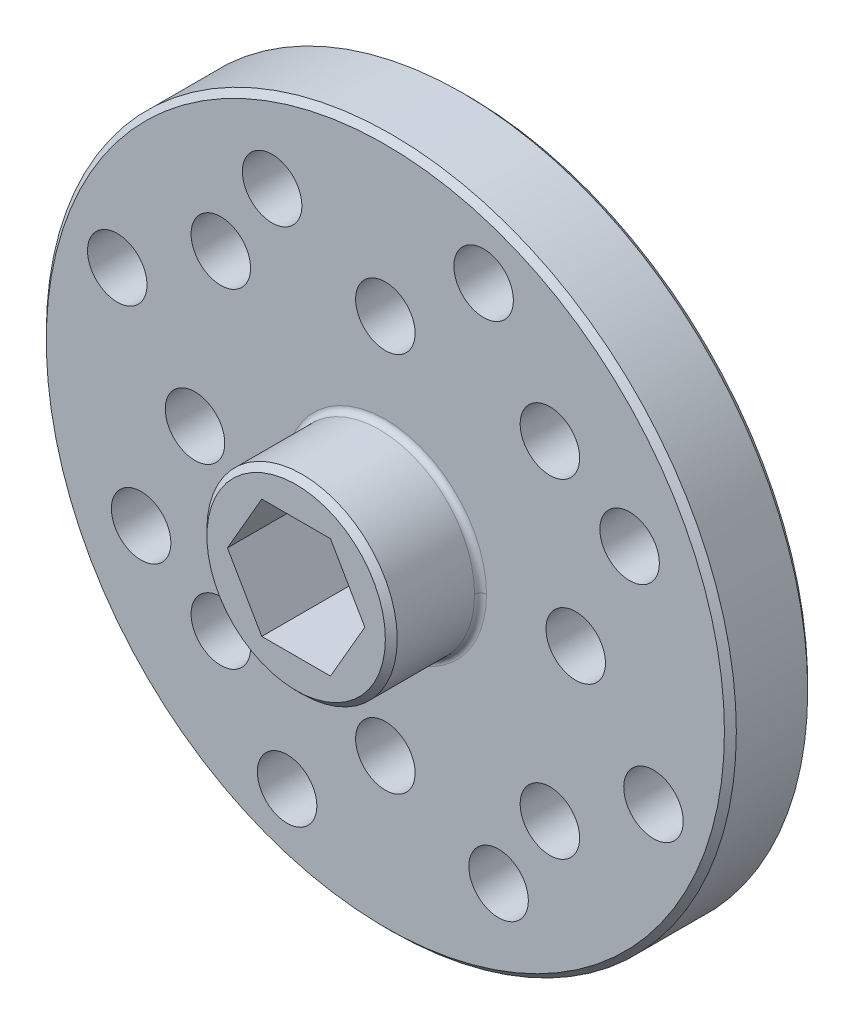
ISO-10303-21;
HEADER;
FILE_DESCRIPTION(('STEP AP214'),'2;1');
FILE_NAME('part.step','',(''),(''),'','','');
FILE_SCHEMA(('AUTOMOTIVE_DESIGN { 1 0 10303 214 1 1 1 1 }'));
ENDSEC;
DATA;
#1=APPLICATION_CONTEXT('core data for automotive mechanical design processes');
#2=APPLICATION_PROTOCOL_DEFINITION('international standard','automotive_design',2000,#1);
#3=PRODUCT_CONTEXT('',#1,'mechanical');
#4=PRODUCT('Part','Part','',(#3));
#5=PRODUCT_RELATED_PRODUCT_CATEGORY('part','',(#4));
#6=PRODUCT_DEFINITION_FORMATION('','',#4);
#7=PRODUCT_DEFINITION_CONTEXT('part definition',#1,'design');
#8=PRODUCT_DEFINITION('design','',#6,#7);
#9=PRODUCT_DEFINITION_SHAPE('','',#8);
#10=(LENGTH_UNIT() NAMED_UNIT(*) SI_UNIT(.MILLI.,.METRE.));
#11=(NAMED_UNIT(*) PLANE_ANGLE_UNIT() SI_UNIT($,.RADIAN.));
#12=(NAMED_UNIT(*) SI_UNIT($,.STERADIAN.) SOLID_ANGLE_UNIT());
#13=UNCERTAINTY_MEASURE_WITH_UNIT(LENGTH_MEASURE(1.E-05),#10,'distance_accuracy_value','');
#14=(GEOMETRIC_REPRESENTATION_CONTEXT(3) GLOBAL_UNCERTAINTY_ASSIGNED_CONTEXT((#13)) GLOBAL_UNIT_ASSIGNED_CONTEXT((#10,
#11,#12)) REPRESENTATION_CONTEXT('',''));
#15=CARTESIAN_POINT('',(0.,0.,0.));
#16=DIRECTION('',(0.,0.,1.));
#17=DIRECTION('',(1.,0.,0.));
#18=AXIS2_PLACEMENT_3D('',#15,#16,#17);
#19=CARTESIAN_POINT('',(0.,0.,7.5));
#20=DIRECTION('',(0.,0.,-1.));
#21=DIRECTION('',(0.,1.,0.));
#22=AXIS2_PLACEMENT_3D('',#19,#20,#21);
#23=TOROIDAL_SURFACE('',#22,4.25,0.25);
#24=CARTESIAN_POINT('',(0.,0.,7.5));
#25=DIRECTION('',(0.,0.,1.));
#26=DIRECTION('',(1.,0.,0.));
#27=AXIS2_PLACEMENT_3D('',#24,#25,#26);
#28=CIRCLE('',#27,4.);
#29=CARTESIAN_POINT('',(-4.,0.,7.5));
#30=VERTEX_POINT('',#29);
#31=CARTESIAN_POINT('',(4.,0.,7.5));
#32=VERTEX_POINT('',#31);
#33=EDGE_CURVE('E273',#30,#32,#28,.T.);
#34=ORIENTED_EDGE('',*,*,#33,.F.);
#35=CARTESIAN_POINT('',(-4.25,0.,7.5));
#36=DIRECTION('',(0.,1.,0.));
#37=DIRECTION('',(-1.,0.,0.));
#38=AXIS2_PLACEMENT_3D('',#35,#36,#37);
#39=CIRCLE('',#38,0.25);
#40=CARTESIAN_POINT('',(-4.25,0.,7.25));
#41=VERTEX_POINT('',#40);
#42=EDGE_CURVE('E268',#30,#41,#39,.T.);
#43=ORIENTED_EDGE('',*,*,#42,.T.);
#44=CARTESIAN_POINT('',(0.,0.,7.25));
#45=DIRECTION('',(0.,0.,1.));
#46=DIRECTION('',(-1.,0.,0.));
#47=AXIS2_PLACEMENT_3D('',#44,#45,#46);
#48=CIRCLE('',#47,4.25);
#49=CARTESIAN_POINT('',(4.25,0.,7.25));
#50=VERTEX_POINT('',#49);
#51=EDGE_CURVE('E251',#41,#50,#48,.T.);
#52=ORIENTED_EDGE('',*,*,#51,.T.);
#53=CARTESIAN_POINT('',(4.25,0.,7.5));
#54=DIRECTION('',(0.,-1.,0.));
#55=DIRECTION('',(1.,0.,0.));
#56=AXIS2_PLACEMENT_3D('',#53,#54,#55);
#57=CIRCLE('',#56,0.25);
#58=EDGE_CURVE('E269',#32,#50,#57,.T.);
#59=ORIENTED_EDGE('',*,*,#58,.F.);
#60=EDGE_LOOP('',(#34,#43,#52,#59));
#61=FACE_BOUND('',#60,.T.);
#62=ADVANCED_FACE('F16',(#61),#23,.F.);
#63=CARTESIAN_POINT('',(0.,0.,3.5));
#64=DIRECTION('',(0.,0.,1.));
#65=DIRECTION('',(0.,-1.,0.));
#66=AXIS2_PLACEMENT_3D('',#63,#64,#65);
#67=TOROIDAL_SURFACE('',#66,6.6,0.249999999999997);
#68=CARTESIAN_POINT('',(0.,0.,3.5));
#69=DIRECTION('',(0.,0.,-1.));
#70=DIRECTION('',(-1.,0.,0.));
#71=AXIS2_PLACEMENT_3D('',#68,#69,#70);
#72=CIRCLE('',#71,6.35);
#73=CARTESIAN_POINT('',(6.35,0.,3.5));
#74=VERTEX_POINT('',#73);
#75=CARTESIAN_POINT('',(-6.35,0.,3.5));
#76=VERTEX_POINT('',#75);
#77=EDGE_CURVE('E375',#74,#76,#72,.T.);
#78=ORIENTED_EDGE('',*,*,#77,.F.);
#79=CARTESIAN_POINT('',(6.6,0.,3.5));
#80=DIRECTION('',(0.,1.,0.));
#81=DIRECTION('',(1.,0.,0.));
#82=AXIS2_PLACEMENT_3D('',#79,#80,#81);
#83=CIRCLE('',#82,0.25);
#84=CARTESIAN_POINT('',(6.6,0.,3.75));
#85=VERTEX_POINT('',#84);
#86=EDGE_CURVE('E322',#74,#85,#83,.T.);
#87=ORIENTED_EDGE('',*,*,#86,.T.);
#88=CARTESIAN_POINT('',(0.,0.,3.75));
#89=DIRECTION('',(0.,0.,-1.));
#90=DIRECTION('',(1.,0.,0.));
#91=AXIS2_PLACEMENT_3D('',#88,#89,#90);
#92=CIRCLE('',#91,6.6);
#93=CARTESIAN_POINT('',(-6.6,0.,3.75));
#94=VERTEX_POINT('',#93);
#95=EDGE_CURVE('E388',#85,#94,#92,.T.);
#96=ORIENTED_EDGE('',*,*,#95,.T.);
#97=CARTESIAN_POINT('',(-6.6,0.,3.5));
#98=DIRECTION('',(0.,-1.,0.));
#99=DIRECTION('',(-1.,0.,0.));
#100=AXIS2_PLACEMENT_3D('',#97,#98,#99);
#101=CIRCLE('',#100,0.25);
#102=EDGE_CURVE('E409',#76,#94,#101,.T.);
#103=ORIENTED_EDGE('',*,*,#102,.F.);
#104=EDGE_LOOP('',(#78,#87,#96,#103));
#105=FACE_BOUND('',#104,.T.);
#106=ADVANCED_FACE('F540',(#105),#67,.F.);
#107=CARTESIAN_POINT('',(0.,0.,7.25));
#108=DIRECTION('',(0.,0.,-1.));
#109=DIRECTION('',(1.,0.,0.));
#110=AXIS2_PLACEMENT_3D('',#107,#108,#109);
#111=CONICAL_SURFACE('',#110,14.25,0.785398163397435);
#112=CARTESIAN_POINT('',(0.,0.,7.25));
#113=DIRECTION('',(0.,0.,1.));
#114=DIRECTION('',(1.,0.,0.));
#115=AXIS2_PLACEMENT_3D('',#112,#113,#114);
#116=CIRCLE('',#115,14.25);
#117=CARTESIAN_POINT('',(14.25,0.,7.25));
#118=VERTEX_POINT('',#117);
#119=EDGE_CURVE('E294',#118,#118,#116,.T.);
#120=ORIENTED_EDGE('',*,*,#119,.F.);
#121=EDGE_LOOP('',(#120));
#122=FACE_BOUND('',#121,.T.);
#123=CARTESIAN_POINT('',(0.,0.,7.));
#124=DIRECTION('',(0.,0.,-1.));
#125=DIRECTION('',(1.,0.,0.));
#126=AXIS2_PLACEMENT_3D('',#123,#124,#125);
#127=CIRCLE('',#126,14.5);
#128=CARTESIAN_POINT('',(14.5,0.,7.));
#129=VERTEX_POINT('',#128);
#130=EDGE_CURVE('E26',#129,#129,#127,.T.);
#131=ORIENTED_EDGE('',*,*,#130,.F.);
#132=EDGE_LOOP('',(#131));
#133=FACE_BOUND('',#132,.T.);
#134=ADVANCED_FACE('F544',(#122,#133),#111,.T.);
#135=CARTESIAN_POINT('',(0.,0.,3.75));
#136=DIRECTION('',(0.,0.,1.));
#137=DIRECTION('',(-1.,0.,0.));
#138=AXIS2_PLACEMENT_3D('',#135,#136,#137);
#139=CONICAL_SURFACE('',#138,14.25,0.785398163397442);
#140=CARTESIAN_POINT('',(0.,0.,3.75));
#141=DIRECTION('',(0.,0.,-1.));
#142=DIRECTION('',(-1.,0.,0.));
#143=AXIS2_PLACEMENT_3D('',#140,#141,#142);
#144=CIRCLE('',#143,14.25);
#145=CARTESIAN_POINT('',(-14.25,0.,3.75));
#146=VERTEX_POINT('',#145);
#147=EDGE_CURVE('E277',#146,#146,#144,.T.);
#148=ORIENTED_EDGE('',*,*,#147,.F.);
#149=EDGE_LOOP('',(#148));
#150=FACE_BOUND('',#149,.T.);
#151=CARTESIAN_POINT('',(0.,0.,4.));
#152=DIRECTION('',(0.,0.,1.));
#153=DIRECTION('',(-1.,0.,0.));
#154=AXIS2_PLACEMENT_3D('',#151,#152,#153);
#155=CIRCLE('',#154,14.5);
#156=CARTESIAN_POINT('',(-14.5,0.,4.));
#157=VERTEX_POINT('',#156);
#158=EDGE_CURVE('E11',#157,#157,#155,.T.);
#159=ORIENTED_EDGE('',*,*,#158,.F.);
#160=EDGE_LOOP('',(#159));
#161=FACE_BOUND('',#160,.T.);
#162=ADVANCED_FACE('F550',(#150,#161),#139,.T.);
#163=CARTESIAN_POINT('',(10.2642437051996,4.75870792970848,7.25));
#164=DIRECTION('',(0.,0.,1.));
#165=DIRECTION('',(0.,-1.,0.));
#166=AXIS2_PLACEMENT_3D('',#163,#164,#165);
#167=CYLINDRICAL_SURFACE('',#166,1.25);
#168=CARTESIAN_POINT('',(10.2642437051996,4.75870792970848,3.75));
#169=DIRECTION('',(0.,0.,1.));
#170=DIRECTION('',(-1.,0.,0.));
#171=AXIS2_PLACEMENT_3D('',#168,#169,#170);
#172=CIRCLE('',#171,1.25);
#173=CARTESIAN_POINT('',(9.0142437051996,4.75870792970848,3.75));
#174=VERTEX_POINT('',#173);
#175=EDGE_CURVE('E285',#174,#174,#172,.T.);
#176=ORIENTED_EDGE('',*,*,#175,.F.);
#177=EDGE_LOOP('',(#176));
#178=FACE_BOUND('',#177,.T.);
#179=CARTESIAN_POINT('',(10.2642437051996,4.75870792970848,7.25));
#180=DIRECTION('',(0.,0.,1.));
#181=DIRECTION('',(0.,-1.,0.));
#182=AXIS2_PLACEMENT_3D('',#179,#180,#181);
#183=CIRCLE('',#182,1.25);
#184=CARTESIAN_POINT('',(10.2642437051996,3.50870792970849,7.25));
#185=VERTEX_POINT('',#184);
#186=EDGE_CURVE('E290',#185,#185,#183,.T.);
#187=ORIENTED_EDGE('',*,*,#186,.T.);
#188=EDGE_LOOP('',(#187));
#189=FACE_BOUND('',#188,.T.);
#190=ADVANCED_FACE('F555',(#178,#189),#167,.F.);
#191=CARTESIAN_POINT('',(-4.75870792970848,10.2642437051996,7.25));
#192=DIRECTION('',(0.,0.,1.));
#193=DIRECTION('',(0.,-1.,0.));
#194=AXIS2_PLACEMENT_3D('',#191,#192,#193);
#195=CYLINDRICAL_SURFACE('',#194,1.25);
#196=CARTESIAN_POINT('',(-4.75870792970848,10.2642437051996,3.75));
#197=DIRECTION('',(0.,0.,1.));
#198=DIRECTION('',(-1.,0.,0.));
#199=AXIS2_PLACEMENT_3D('',#196,#197,#198);
#200=CIRCLE('',#199,1.25);
#201=CARTESIAN_POINT('',(-6.00870792970848,10.2642437051996,3.75));
#202=VERTEX_POINT('',#201);
#203=EDGE_CURVE('E298',#202,#202,#200,.T.);
#204=ORIENTED_EDGE('',*,*,#203,.F.);
#205=EDGE_LOOP('',(#204));
#206=FACE_BOUND('',#205,.T.);
#207=CARTESIAN_POINT('',(-4.75870792970848,10.2642437051996,7.25));
#208=DIRECTION('',(0.,0.,1.));
#209=DIRECTION('',(0.,-1.,0.));
#210=AXIS2_PLACEMENT_3D('',#207,#208,#209);
#211=CIRCLE('',#210,1.25);
#212=CARTESIAN_POINT('',(-4.75870792970848,9.01424370519961,7.25));
#213=VERTEX_POINT('',#212);
#214=EDGE_CURVE('E289',#213,#213,#211,.T.);
#215=ORIENTED_EDGE('',*,*,#214,.T.);
#216=EDGE_LOOP('',(#215));
#217=FACE_BOUND('',#216,.T.);
#218=ADVANCED_FACE('F533',(#206,#217),#195,.F.);
#219=CARTESIAN_POINT('',(-10.2642437051996,-4.75870792970848,7.25));
#220=DIRECTION('',(0.,0.,1.));
#221=DIRECTION('',(0.,-1.,0.));
#222=AXIS2_PLACEMENT_3D('',#219,#220,#221);
#223=CYLINDRICAL_SURFACE('',#222,1.25);
#224=CARTESIAN_POINT('',(-10.2642437051996,-4.75870792970848,3.75));
#225=DIRECTION('',(0.,0.,1.));
#226=DIRECTION('',(-1.,0.,0.));
#227=AXIS2_PLACEMENT_3D('',#224,#225,#226);
#228=CIRCLE('',#227,1.25);
#229=CARTESIAN_POINT('',(-11.5142437051996,-4.75870792970848,3.75));
#230=VERTEX_POINT('',#229);
#231=EDGE_CURVE('E295',#230,#230,#228,.T.);
#232=ORIENTED_EDGE('',*,*,#231,.F.);
#233=EDGE_LOOP('',(#232));
#234=FACE_BOUND('',#233,.T.);
#235=CARTESIAN_POINT('',(-10.2642437051996,-4.75870792970848,7.25));
#236=DIRECTION('',(0.,0.,1.));
#237=DIRECTION('',(0.,-1.,0.));
#238=AXIS2_PLACEMENT_3D('',#235,#236,#237);
#239=CIRCLE('',#238,1.25);
#240=CARTESIAN_POINT('',(-10.2642437051996,-6.00870792970847,7.25));
#241=VERTEX_POINT('',#240);
#242=EDGE_CURVE('E19',#241,#241,#239,.T.);
#243=ORIENTED_EDGE('',*,*,#242,.T.);
#244=EDGE_LOOP('',(#243));
#245=FACE_BOUND('',#244,.T.);
#246=ADVANCED_FACE('F523',(#234,#245),#223,.F.);
#247=CARTESIAN_POINT('',(4.75870792970848,-10.2642437051996,7.25));
#248=DIRECTION('',(0.,0.,1.));
#249=DIRECTION('',(0.,-1.,0.));
#250=AXIS2_PLACEMENT_3D('',#247,#248,#249);
#251=CYLINDRICAL_SURFACE('',#250,1.25);
#252=CARTESIAN_POINT('',(4.75870792970848,-10.2642437051996,3.75));
#253=DIRECTION('',(0.,0.,1.));
#254=DIRECTION('',(-1.,0.,0.));
#255=AXIS2_PLACEMENT_3D('',#252,#253,#254);
#256=CIRCLE('',#255,1.25);
#257=CARTESIAN_POINT('',(3.50870792970848,-10.2642437051996,3.75));
#258=VERTEX_POINT('',#257);
#259=EDGE_CURVE('E299',#258,#258,#256,.T.);
#260=ORIENTED_EDGE('',*,*,#259,.F.);
#261=EDGE_LOOP('',(#260));
#262=FACE_BOUND('',#261,.T.);
#263=CARTESIAN_POINT('',(4.75870792970848,-10.2642437051996,7.25));
#264=DIRECTION('',(0.,0.,1.));
#265=DIRECTION('',(0.,-1.,0.));
#266=AXIS2_PLACEMENT_3D('',#263,#264,#265);
#267=CIRCLE('',#266,1.25);
#268=CARTESIAN_POINT('',(4.75870792970848,-11.5142437051996,7.25));
#269=VERTEX_POINT('',#268);
#270=EDGE_CURVE('E271',#269,#269,#267,.T.);
#271=ORIENTED_EDGE('',*,*,#270,.T.);
#272=EDGE_LOOP('',(#271));
#273=FACE_BOUND('',#272,.T.);
#274=ADVANCED_FACE('F521',(#262,#273),#251,.F.);
#275=CARTESIAN_POINT('',(4.12915183161834,11.2672137261811,7.25));
#276=DIRECTION('',(0.,0.,1.));
#277=DIRECTION('',(0.,-1.,0.));
#278=AXIS2_PLACEMENT_3D('',#275,#276,#277);
#279=CYLINDRICAL_SURFACE('',#278,1.25);
#280=CARTESIAN_POINT('',(4.12915183161834,11.2672137261811,3.75));
#281=DIRECTION('',(0.,0.,1.));
#282=DIRECTION('',(-1.,0.,0.));
#283=AXIS2_PLACEMENT_3D('',#280,#281,#282);
#284=CIRCLE('',#283,1.25);
#285=CARTESIAN_POINT('',(2.87915183161833,11.2672137261811,3.75));
#286=VERTEX_POINT('',#285);
#287=EDGE_CURVE('E444',#286,#286,#284,.T.);
#288=ORIENTED_EDGE('',*,*,#287,.F.);
#289=EDGE_LOOP('',(#288));
#290=FACE_BOUND('',#289,.T.);
#291=CARTESIAN_POINT('',(4.12915183161834,11.2672137261811,7.25));
#292=DIRECTION('',(0.,0.,1.));
#293=DIRECTION('',(0.,-1.,0.));
#294=AXIS2_PLACEMENT_3D('',#291,#292,#293);
#295=CIRCLE('',#294,1.25);
#296=CARTESIAN_POINT('',(4.12915183161834,10.0172137261811,7.25));
#297=VERTEX_POINT('',#296);
#298=EDGE_CURVE('E320',#297,#297,#295,.T.);
#299=ORIENTED_EDGE('',*,*,#298,.T.);
#300=EDGE_LOOP('',(#299));
#301=FACE_BOUND('',#300,.T.);
#302=ADVANCED_FACE('F511',(#290,#301),#279,.F.);
#303=CARTESIAN_POINT('',(-11.2672137261811,4.12915183161834,7.25));
#304=DIRECTION('',(0.,0.,1.));
#305=DIRECTION('',(0.,-1.,0.));
#306=AXIS2_PLACEMENT_3D('',#303,#304,#305);
#307=CYLINDRICAL_SURFACE('',#306,1.25);
#308=CARTESIAN_POINT('',(-11.2672137261811,4.12915183161834,3.75));
#309=DIRECTION('',(0.,0.,1.));
#310=DIRECTION('',(-1.,0.,0.));
#311=AXIS2_PLACEMENT_3D('',#308,#309,#310);
#312=CIRCLE('',#311,1.25);
#313=CARTESIAN_POINT('',(-12.5172137261811,4.12915183161834,3.75));
#314=VERTEX_POINT('',#313);
#315=EDGE_CURVE('E447',#314,#314,#312,.T.);
#316=ORIENTED_EDGE('',*,*,#315,.F.);
#317=EDGE_LOOP('',(#316));
#318=FACE_BOUND('',#317,.T.);
#319=CARTESIAN_POINT('',(-11.2672137261811,4.12915183161834,7.25));
#320=DIRECTION('',(0.,0.,1.));
#321=DIRECTION('',(0.,-1.,0.));
#322=AXIS2_PLACEMENT_3D('',#319,#320,#321);
#323=CIRCLE('',#322,1.25);
#324=CARTESIAN_POINT('',(-11.2672137261811,2.87915183161835,7.25));
#325=VERTEX_POINT('',#324);
#326=EDGE_CURVE('E342',#325,#325,#323,.T.);
#327=ORIENTED_EDGE('',*,*,#326,.T.);
#328=EDGE_LOOP('',(#327));
#329=FACE_BOUND('',#328,.T.);
#330=ADVANCED_FACE('F507',(#318,#329),#307,.F.);
#331=CARTESIAN_POINT('',(11.267213726181,-4.12915183161834,7.25));
#332=DIRECTION('',(0.,0.,1.));
#333=DIRECTION('',(0.,-1.,0.));
#334=AXIS2_PLACEMENT_3D('',#331,#332,#333);
#335=CYLINDRICAL_SURFACE('',#334,1.25);
#336=CARTESIAN_POINT('',(11.267213726181,-4.12915183161834,3.75));
#337=DIRECTION('',(0.,0.,1.));
#338=DIRECTION('',(-1.,0.,0.));
#339=AXIS2_PLACEMENT_3D('',#336,#337,#338);
#340=CIRCLE('',#339,1.25);
#341=CARTESIAN_POINT('',(10.017213726181,-4.12915183161834,3.75));
#342=VERTEX_POINT('',#341);
#343=EDGE_CURVE('E363',#342,#342,#340,.T.);
#344=ORIENTED_EDGE('',*,*,#343,.F.);
#345=EDGE_LOOP('',(#344));
#346=FACE_BOUND('',#345,.T.);
#347=CARTESIAN_POINT('',(11.267213726181,-4.12915183161834,7.25));
#348=DIRECTION('',(0.,0.,1.));
#349=DIRECTION('',(0.,-1.,0.));
#350=AXIS2_PLACEMENT_3D('',#347,#348,#349);
#351=CIRCLE('',#350,1.25);
#352=CARTESIAN_POINT('',(11.267213726181,-5.37915183161833,7.25));
#353=VERTEX_POINT('',#352);
#354=EDGE_CURVE('E317',#353,#353,#351,.T.);
#355=ORIENTED_EDGE('',*,*,#354,.T.);
#356=EDGE_LOOP('',(#355));
#357=FACE_BOUND('',#356,.T.);
#358=ADVANCED_FACE('F510',(#346,#357),#335,.F.);
#359=CARTESIAN_POINT('',(-4.12915183161834,-11.2672137261811,7.25));
#360=DIRECTION('',(0.,0.,1.));
#361=DIRECTION('',(0.,-1.,0.));
#362=AXIS2_PLACEMENT_3D('',#359,#360,#361);
#363=CYLINDRICAL_SURFACE('',#362,1.25);
#364=CARTESIAN_POINT('',(-4.12915183161834,-11.2672137261811,3.75));
#365=DIRECTION('',(0.,0.,1.));
#366=DIRECTION('',(-1.,0.,0.));
#367=AXIS2_PLACEMENT_3D('',#364,#365,#366);
#368=CIRCLE('',#367,1.25);
#369=CARTESIAN_POINT('',(-5.37915183161834,-11.2672137261811,3.75));
#370=VERTEX_POINT('',#369);
#371=EDGE_CURVE('E355',#370,#370,#368,.T.);
#372=ORIENTED_EDGE('',*,*,#371,.F.);
#373=EDGE_LOOP('',(#372));
#374=FACE_BOUND('',#373,.T.);
#375=CARTESIAN_POINT('',(-4.12915183161834,-11.2672137261811,7.25));
#376=DIRECTION('',(0.,0.,1.));
#377=DIRECTION('',(0.,-1.,0.));
#378=AXIS2_PLACEMENT_3D('',#375,#376,#377);
#379=CIRCLE('',#378,1.25);
#380=CARTESIAN_POINT('',(-4.12915183161834,-12.517213726181,7.25));
#381=VERTEX_POINT('',#380);
#382=EDGE_CURVE('E345',#381,#381,#379,.T.);
#383=ORIENTED_EDGE('',*,*,#382,.T.);
#384=EDGE_LOOP('',(#383));
#385=FACE_BOUND('',#384,.T.);
#386=ADVANCED_FACE('F578',(#374,#385),#363,.F.);
#387=CARTESIAN_POINT('',(6.91479721322321,6.91479721322329,7.25));
#388=DIRECTION('',(0.,0.,1.));
#389=DIRECTION('',(0.,-1.,0.));
#390=AXIS2_PLACEMENT_3D('',#387,#388,#389);
#391=CYLINDRICAL_SURFACE('',#390,1.25);
#392=CARTESIAN_POINT('',(6.91479721322321,6.91479721322329,3.75));
#393=DIRECTION('',(0.,0.,1.));
#394=DIRECTION('',(-1.,0.,0.));
#395=AXIS2_PLACEMENT_3D('',#392,#393,#394);
#396=CIRCLE('',#395,1.25);
#397=CARTESIAN_POINT('',(5.66479721322321,6.91479721322329,3.75));
#398=VERTEX_POINT('',#397);
#399=EDGE_CURVE('E349',#398,#398,#396,.T.);
#400=ORIENTED_EDGE('',*,*,#399,.F.);
#401=EDGE_LOOP('',(#400));
#402=FACE_BOUND('',#401,.T.);
#403=CARTESIAN_POINT('',(6.91479721322321,6.91479721322329,7.25));
#404=DIRECTION('',(0.,0.,1.));
#405=DIRECTION('',(0.,-1.,0.));
#406=AXIS2_PLACEMENT_3D('',#403,#404,#405);
#407=CIRCLE('',#406,1.25);
#408=CARTESIAN_POINT('',(6.91479721322321,5.6647972132233,7.25));
#409=VERTEX_POINT('',#408);
#410=EDGE_CURVE('E473',#409,#409,#407,.T.);
#411=ORIENTED_EDGE('',*,*,#410,.T.);
#412=EDGE_LOOP('',(#411));
#413=FACE_BOUND('',#412,.T.);
#414=ADVANCED_FACE('F574',(#402,#413),#391,.F.);
#415=CARTESIAN_POINT('',(0.,8.,7.25));
#416=DIRECTION('',(0.,0.,1.));
#417=DIRECTION('',(0.,-1.,0.));
#418=AXIS2_PLACEMENT_3D('',#415,#416,#417);
#419=CYLINDRICAL_SURFACE('',#418,1.25);
#420=CARTESIAN_POINT('',(0.,8.,3.75));
#421=DIRECTION('',(0.,0.,1.));
#422=DIRECTION('',(-1.,0.,0.));
#423=AXIS2_PLACEMENT_3D('',#420,#421,#422);
#424=CIRCLE('',#423,1.25);
#425=CARTESIAN_POINT('',(-1.25,8.,3.75));
#426=VERTEX_POINT('',#425);
#427=EDGE_CURVE('E309',#426,#426,#424,.T.);
#428=ORIENTED_EDGE('',*,*,#427,.F.);
#429=EDGE_LOOP('',(#428));
#430=FACE_BOUND('',#429,.T.);
#431=CARTESIAN_POINT('',(0.,8.,7.25));
#432=DIRECTION('',(0.,0.,1.));
#433=DIRECTION('',(0.,-1.,0.));
#434=AXIS2_PLACEMENT_3D('',#431,#432,#433);
#435=CIRCLE('',#434,1.25);
#436=CARTESIAN_POINT('',(0.,6.75,7.25));
#437=VERTEX_POINT('',#436);
#438=EDGE_CURVE('E379',#437,#437,#435,.T.);
#439=ORIENTED_EDGE('',*,*,#438,.T.);
#440=EDGE_LOOP('',(#439));
#441=FACE_BOUND('',#440,.T.);
#442=ADVANCED_FACE('F577',(#430,#441),#419,.F.);
#443=CARTESIAN_POINT('',(-6.91479721322331,6.91479721322318,7.25));
#444=DIRECTION('',(0.,0.,1.));
#445=DIRECTION('',(0.,-1.,0.));
#446=AXIS2_PLACEMENT_3D('',#443,#444,#445);
#447=CYLINDRICAL_SURFACE('',#446,1.25);
#448=CARTESIAN_POINT('',(-6.91479721322331,6.91479721322318,3.75));
#449=DIRECTION('',(0.,0.,1.));
#450=DIRECTION('',(-1.,0.,0.));
#451=AXIS2_PLACEMENT_3D('',#448,#449,#450);
#452=CIRCLE('',#451,1.25);
#453=CARTESIAN_POINT('',(-8.16479721322331,6.91479721322318,3.75));
#454=VERTEX_POINT('',#453);
#455=EDGE_CURVE('E306',#454,#454,#452,.T.);
#456=ORIENTED_EDGE('',*,*,#455,.F.);
#457=EDGE_LOOP('',(#456));
#458=FACE_BOUND('',#457,.T.);
#459=CARTESIAN_POINT('',(-6.91479721322331,6.91479721322318,7.25));
#460=DIRECTION('',(0.,0.,1.));
#461=DIRECTION('',(0.,-1.,0.));
#462=AXIS2_PLACEMENT_3D('',#459,#460,#461);
#463=CIRCLE('',#462,1.25);
#464=CARTESIAN_POINT('',(-6.91479721322331,5.6647972132232,7.25));
#465=VERTEX_POINT('',#464);
#466=EDGE_CURVE('E321',#465,#465,#463,.T.);
#467=ORIENTED_EDGE('',*,*,#466,.T.);
#468=EDGE_LOOP('',(#467));
#469=FACE_BOUND('',#468,.T.);
#470=ADVANCED_FACE('F598',(#458,#469),#447,.F.);
#471=CARTESIAN_POINT('',(-8.,0.,7.25));
#472=DIRECTION('',(0.,0.,1.));
#473=DIRECTION('',(0.,-1.,0.));
#474=AXIS2_PLACEMENT_3D('',#471,#472,#473);
#475=CYLINDRICAL_SURFACE('',#474,1.25);
#476=CARTESIAN_POINT('',(-8.,0.,3.75));
#477=DIRECTION('',(0.,0.,1.));
#478=DIRECTION('',(-1.,0.,0.));
#479=AXIS2_PLACEMENT_3D('',#476,#477,#478);
#480=CIRCLE('',#479,1.25);
#481=CARTESIAN_POINT('',(-9.25,0.,3.75));
#482=VERTEX_POINT('',#481);
#483=EDGE_CURVE('E310',#482,#482,#480,.T.);
#484=ORIENTED_EDGE('',*,*,#483,.F.);
#485=EDGE_LOOP('',(#484));
#486=FACE_BOUND('',#485,.T.);
#487=CARTESIAN_POINT('',(-8.,0.,7.25));
#488=DIRECTION('',(0.,0.,1.));
#489=DIRECTION('',(0.,-1.,0.));
#490=AXIS2_PLACEMENT_3D('',#487,#488,#489);
#491=CIRCLE('',#490,1.25);
#492=CARTESIAN_POINT('',(-8.,-1.25,7.25));
#493=VERTEX_POINT('',#492);
#494=EDGE_CURVE('E438',#493,#493,#491,.T.);
#495=ORIENTED_EDGE('',*,*,#494,.T.);
#496=EDGE_LOOP('',(#495));
#497=FACE_BOUND('',#496,.T.);
#498=ADVANCED_FACE('F591',(#486,#497),#475,.F.);
#499=CARTESIAN_POINT('',(-6.91479721322321,-6.91479721322329,7.25));
#500=DIRECTION('',(0.,0.,1.));
#501=DIRECTION('',(0.,-1.,0.));
#502=AXIS2_PLACEMENT_3D('',#499,#500,#501);
#503=CYLINDRICAL_SURFACE('',#502,1.25);
#504=CARTESIAN_POINT('',(-6.91479721322321,-6.91479721322329,3.75));
#505=DIRECTION('',(0.,0.,1.));
#506=DIRECTION('',(-1.,0.,0.));
#507=AXIS2_PLACEMENT_3D('',#504,#505,#506);
#508=CIRCLE('',#507,1.25);
#509=CARTESIAN_POINT('',(-8.16479721322321,-6.91479721322329,3.75));
#510=VERTEX_POINT('',#509);
#511=EDGE_CURVE('E311',#510,#510,#508,.T.);
#512=ORIENTED_EDGE('',*,*,#511,.F.);
#513=EDGE_LOOP('',(#512));
#514=FACE_BOUND('',#513,.T.);
#515=CARTESIAN_POINT('',(-6.91479721322321,-6.91479721322329,7.25));
#516=DIRECTION('',(0.,0.,1.));
#517=DIRECTION('',(0.,-1.,0.));
#518=AXIS2_PLACEMENT_3D('',#515,#516,#517);
#519=CIRCLE('',#518,1.25);
#520=CARTESIAN_POINT('',(-6.91479721322321,-8.16479721322328,7.25));
#521=VERTEX_POINT('',#520);
#522=EDGE_CURVE('E441',#521,#521,#519,.T.);
#523=ORIENTED_EDGE('',*,*,#522,.T.);
#524=EDGE_LOOP('',(#523));
#525=FACE_BOUND('',#524,.T.);
#526=ADVANCED_FACE('F587',(#514,#525),#503,.F.);
#527=CARTESIAN_POINT('',(0.,-8.,7.25));
#528=DIRECTION('',(0.,0.,1.));
#529=DIRECTION('',(0.,-1.,0.));
#530=AXIS2_PLACEMENT_3D('',#527,#528,#529);
#531=CYLINDRICAL_SURFACE('',#530,1.25);
#532=CARTESIAN_POINT('',(0.,-8.,3.75));
#533=DIRECTION('',(0.,0.,1.));
#534=DIRECTION('',(-1.,0.,0.));
#535=AXIS2_PLACEMENT_3D('',#532,#533,#534);
#536=CIRCLE('',#535,1.25);
#537=CARTESIAN_POINT('',(-1.25,-8.,3.75));
#538=VERTEX_POINT('',#537);
#539=EDGE_CURVE('E314',#538,#538,#536,.T.);
#540=ORIENTED_EDGE('',*,*,#539,.F.);
#541=EDGE_LOOP('',(#540));
#542=FACE_BOUND('',#541,.T.);
#543=CARTESIAN_POINT('',(0.,-8.,7.25));
#544=DIRECTION('',(0.,0.,1.));
#545=DIRECTION('',(0.,-1.,0.));
#546=AXIS2_PLACEMENT_3D('',#543,#544,#545);
#547=CIRCLE('',#546,1.25);
#548=CARTESIAN_POINT('',(0.,-9.25,7.25));
#549=VERTEX_POINT('',#548);
#550=EDGE_CURVE('E406',#549,#549,#547,.T.);
#551=ORIENTED_EDGE('',*,*,#550,.T.);
#552=EDGE_LOOP('',(#551));
#553=FACE_BOUND('',#552,.T.);
#554=ADVANCED_FACE('F590',(#542,#553),#531,.F.);
#555=CARTESIAN_POINT('',(6.91479721322336,-6.91479721322314,7.25));
#556=DIRECTION('',(0.,0.,1.));
#557=DIRECTION('',(0.,-1.,0.));
#558=AXIS2_PLACEMENT_3D('',#555,#556,#557);
#559=CYLINDRICAL_SURFACE('',#558,1.25);
#560=CARTESIAN_POINT('',(6.91479721322336,-6.91479721322314,3.75));
#561=DIRECTION('',(0.,0.,1.));
#562=DIRECTION('',(-1.,0.,0.));
#563=AXIS2_PLACEMENT_3D('',#560,#561,#562);
#564=CIRCLE('',#563,1.25);
#565=CARTESIAN_POINT('',(5.66479721322336,-6.91479721322314,3.75));
#566=VERTEX_POINT('',#565);
#567=EDGE_CURVE('E387',#566,#566,#564,.T.);
#568=ORIENTED_EDGE('',*,*,#567,.F.);
#569=EDGE_LOOP('',(#568));
#570=FACE_BOUND('',#569,.T.);
#571=CARTESIAN_POINT('',(6.91479721322336,-6.91479721322314,7.25));
#572=DIRECTION('',(0.,0.,1.));
#573=DIRECTION('',(0.,-1.,0.));
#574=AXIS2_PLACEMENT_3D('',#571,#572,#573);
#575=CIRCLE('',#574,1.25);
#576=CARTESIAN_POINT('',(6.91479721322336,-8.16479721322313,7.25));
#577=VERTEX_POINT('',#576);
#578=EDGE_CURVE('E261',#577,#577,#575,.T.);
#579=ORIENTED_EDGE('',*,*,#578,.T.);
#580=EDGE_LOOP('',(#579));
#581=FACE_BOUND('',#580,.T.);
#582=ADVANCED_FACE('F613',(#570,#581),#559,.F.);
#583=CARTESIAN_POINT('',(8.,0.,7.25));
#584=DIRECTION('',(0.,0.,1.));
#585=DIRECTION('',(0.,-1.,0.));
#586=AXIS2_PLACEMENT_3D('',#583,#584,#585);
#587=CYLINDRICAL_SURFACE('',#586,1.25);
#588=CARTESIAN_POINT('',(8.,0.,3.75));
#589=DIRECTION('',(0.,0.,1.));
#590=DIRECTION('',(-1.,0.,0.));
#591=AXIS2_PLACEMENT_3D('',#588,#589,#590);
#592=CIRCLE('',#591,1.25);
#593=CARTESIAN_POINT('',(6.75,0.,3.75));
#594=VERTEX_POINT('',#593);
#595=EDGE_CURVE('E367',#594,#594,#592,.T.);
#596=ORIENTED_EDGE('',*,*,#595,.F.);
#597=EDGE_LOOP('',(#596));
#598=FACE_BOUND('',#597,.T.);
#599=CARTESIAN_POINT('',(8.,0.,7.25));
#600=DIRECTION('',(0.,0.,1.));
#601=DIRECTION('',(0.,-1.,0.));
#602=AXIS2_PLACEMENT_3D('',#599,#600,#601);
#603=CIRCLE('',#602,1.25);
#604=CARTESIAN_POINT('',(8.,-1.2499999999999,7.25));
#605=VERTEX_POINT('',#604);
#606=EDGE_CURVE('E262',#605,#605,#603,.T.);
#607=ORIENTED_EDGE('',*,*,#606,.T.);
#608=EDGE_LOOP('',(#607));
#609=FACE_BOUND('',#608,.T.);
#610=ADVANCED_FACE('F573',(#598,#609),#587,.F.);
#611=CARTESIAN_POINT('',(0.,0.,-37.2621933088198));
#612=DIRECTION('',(0.,0.,1.));
#613=DIRECTION('',(-1.,0.,0.));
#614=AXIS2_PLACEMENT_3D('',#611,#612,#613);
#615=CYLINDRICAL_SURFACE('',#614,14.5);
#616=ORIENTED_EDGE('',*,*,#158,.T.);
#617=EDGE_LOOP('',(#616));
#618=FACE_BOUND('',#617,.T.);
#619=ORIENTED_EDGE('',*,*,#130,.T.);
#620=EDGE_LOOP('',(#619));
#621=FACE_BOUND('',#620,.T.);
#622=ADVANCED_FACE('F569',(#618,#621),#615,.T.);
#623=CARTESIAN_POINT('',(0.,0.,0.));
#624=DIRECTION('',(0.,0.,1.));
#625=DIRECTION('',(-1.,0.,0.));
#626=AXIS2_PLACEMENT_3D('',#623,#624,#625);
#627=CYLINDRICAL_SURFACE('',#626,4.);
#628=ORIENTED_EDGE('',*,*,#33,.T.);
#629=CARTESIAN_POINT('',(0.,0.,7.5));
#630=DIRECTION('',(0.,0.,1.));
#631=DIRECTION('',(1.,0.,0.));
#632=AXIS2_PLACEMENT_3D('',#629,#630,#631);
#633=CIRCLE('',#632,4.);
#634=EDGE_CURVE('E276',#32,#30,#633,.T.);
#635=ORIENTED_EDGE('',*,*,#634,.T.);
#636=EDGE_LOOP('',(#628,#635));
#637=FACE_BOUND('',#636,.T.);
#638=CARTESIAN_POINT('',(0.,0.,10.75));
#639=DIRECTION('',(0.,0.,-1.));
#640=DIRECTION('',(-1.,0.,0.));
#641=AXIS2_PLACEMENT_3D('',#638,#639,#640);
#642=CIRCLE('',#641,4.);
#643=CARTESIAN_POINT('',(-4.,0.,10.75));
#644=VERTEX_POINT('',#643);
#645=EDGE_CURVE('E372',#644,#644,#642,.T.);
#646=ORIENTED_EDGE('',*,*,#645,.T.);
#647=EDGE_LOOP('',(#646));
#648=FACE_BOUND('',#647,.T.);
#649=ADVANCED_FACE('F572',(#637,#648),#627,.T.);
#650=CARTESIAN_POINT('',(0.,0.,10.7500000000869));
#651=DIRECTION('',(0.,0.,-1.));
#652=DIRECTION('',(1.,0.,0.));
#653=AXIS2_PLACEMENT_3D('',#650,#651,#652);
#654=CONICAL_SURFACE('',#653,3.99999999996226,0.785398163397448);
#655=CARTESIAN_POINT('',(0.,0.,11.0000000000241));
#656=DIRECTION('',(0.,0.,-1.));
#657=DIRECTION('',(1.,0.,0.));
#658=AXIS2_PLACEMENT_3D('',#655,#656,#657);
#659=CIRCLE('',#658,3.75000000002502);
#660=CARTESIAN_POINT('',(3.75000000002501,0.,11.0000000000241));
#661=VERTEX_POINT('',#660);
#662=EDGE_CURVE('E327',#661,#661,#659,.T.);
#663=ORIENTED_EDGE('',*,*,#662,.T.);
#664=EDGE_LOOP('',(#663));
#665=FACE_BOUND('',#664,.T.);
#666=ORIENTED_EDGE('',*,*,#645,.F.);
#667=EDGE_LOOP('',(#666));
#668=FACE_BOUND('',#667,.T.);
#669=ADVANCED_FACE('F603',(#665,#668),#654,.T.);
#670=CARTESIAN_POINT('',(0.,0.,0.));
#671=DIRECTION('',(0.,0.,1.));
#672=DIRECTION('',(-1.,0.,0.));
#673=AXIS2_PLACEMENT_3D('',#670,#671,#672);
#674=CYLINDRICAL_SURFACE('',#673,6.35);
#675=CARTESIAN_POINT('',(0.,0.,0.250000000000004));
#676=DIRECTION('',(0.,0.,1.));
#677=DIRECTION('',(-1.,0.,0.));
#678=AXIS2_PLACEMENT_3D('',#675,#676,#677);
#679=CIRCLE('',#678,6.35);
#680=CARTESIAN_POINT('',(-6.35,0.,0.25));
#681=VERTEX_POINT('',#680);
#682=EDGE_CURVE('E347',#681,#681,#679,.T.);
#683=ORIENTED_EDGE('',*,*,#682,.T.);
#684=EDGE_LOOP('',(#683));
#685=FACE_BOUND('',#684,.T.);
#686=ORIENTED_EDGE('',*,*,#77,.T.);
#687=CARTESIAN_POINT('',(0.,0.,3.5));
#688=DIRECTION('',(0.,0.,-1.));
#689=DIRECTION('',(-1.,0.,0.));
#690=AXIS2_PLACEMENT_3D('',#687,#688,#689);
#691=CIRCLE('',#690,6.35);
#692=EDGE_CURVE('E326',#76,#74,#691,.T.);
#693=ORIENTED_EDGE('',*,*,#692,.T.);
#694=EDGE_LOOP('',(#686,#693));
#695=FACE_BOUND('',#694,.T.);
#696=ADVANCED_FACE('F606',(#685,#695),#674,.T.);
#697=CARTESIAN_POINT('',(0.,0.,0.249999999994089));
#698=DIRECTION('',(0.,0.,1.));
#699=DIRECTION('',(-1.,0.,0.));
#700=AXIS2_PLACEMENT_3D('',#697,#698,#699);
#701=CONICAL_SURFACE('',#700,6.34999999994079,0.785398163397448);
#702=CARTESIAN_POINT('',(0.,0.,5.68442320124374E-11));
#703=DIRECTION('',(0.,0.,1.));
#704=DIRECTION('',(-1.,0.,0.));
#705=AXIS2_PLACEMENT_3D('',#702,#703,#704);
#706=CIRCLE('',#705,6.10000000000355);
#707=CARTESIAN_POINT('',(-6.10000000000355,0.,5.68435029505041E-11));
#708=VERTEX_POINT('',#707);
#709=EDGE_CURVE('E305',#708,#708,#706,.T.);
#710=ORIENTED_EDGE('',*,*,#709,.T.);
#711=EDGE_LOOP('',(#710));
#712=FACE_BOUND('',#711,.T.);
#713=ORIENTED_EDGE('',*,*,#682,.F.);
#714=EDGE_LOOP('',(#713));
#715=FACE_BOUND('',#714,.T.);
#716=ADVANCED_FACE('F516',(#712,#715),#701,.T.);
#717=CARTESIAN_POINT('',(4.,0.,7.25));
#718=DIRECTION('',(0.,0.,-1.));
#719=DIRECTION('',(0.,-1.,0.));
#720=AXIS2_PLACEMENT_3D('',#717,#718,#719);
#721=PLANE('',#720);
#722=ORIENTED_EDGE('',*,*,#119,.T.);
#723=EDGE_LOOP('',(#722));
#724=FACE_BOUND('',#723,.T.);
#725=ORIENTED_EDGE('',*,*,#186,.F.);
#726=EDGE_LOOP('',(#725));
#727=FACE_BOUND('',#726,.T.);
#728=ORIENTED_EDGE('',*,*,#214,.F.);
#729=EDGE_LOOP('',(#728));
#730=FACE_BOUND('',#729,.T.);
#731=ORIENTED_EDGE('',*,*,#242,.F.);
#732=EDGE_LOOP('',(#731));
#733=FACE_BOUND('',#732,.T.);
#734=ORIENTED_EDGE('',*,*,#298,.F.);
#735=EDGE_LOOP('',(#734));
#736=FACE_BOUND('',#735,.T.);
#737=ORIENTED_EDGE('',*,*,#354,.F.);
#738=EDGE_LOOP('',(#737));
#739=FACE_BOUND('',#738,.T.);
#740=ORIENTED_EDGE('',*,*,#466,.F.);
#741=EDGE_LOOP('',(#740));
#742=FACE_BOUND('',#741,.T.);
#743=ORIENTED_EDGE('',*,*,#494,.F.);
#744=EDGE_LOOP('',(#743));
#745=FACE_BOUND('',#744,.T.);
#746=ORIENTED_EDGE('',*,*,#522,.F.);
#747=EDGE_LOOP('',(#746));
#748=FACE_BOUND('',#747,.T.);
#749=ORIENTED_EDGE('',*,*,#550,.F.);
#750=EDGE_LOOP('',(#749));
#751=FACE_BOUND('',#750,.T.);
#752=ORIENTED_EDGE('',*,*,#578,.F.);
#753=EDGE_LOOP('',(#752));
#754=FACE_BOUND('',#753,.T.);
#755=CARTESIAN_POINT('',(0.,0.,7.25));
#756=DIRECTION('',(0.,0.,1.));
#757=DIRECTION('',(1.,0.,0.));
#758=AXIS2_PLACEMENT_3D('',#755,#756,#757);
#759=CIRCLE('',#758,4.25);
#760=EDGE_CURVE('E255',#50,#41,#759,.T.);
#761=ORIENTED_EDGE('',*,*,#760,.F.);
#762=ORIENTED_EDGE('',*,*,#51,.F.);
#763=EDGE_LOOP('',(#761,#762));
#764=FACE_BOUND('',#763,.T.);
#765=ORIENTED_EDGE('',*,*,#606,.F.);
#766=EDGE_LOOP('',(#765));
#767=FACE_BOUND('',#766,.T.);
#768=ORIENTED_EDGE('',*,*,#438,.F.);
#769=EDGE_LOOP('',(#768));
#770=FACE_BOUND('',#769,.T.);
#771=ORIENTED_EDGE('',*,*,#410,.F.);
#772=EDGE_LOOP('',(#771));
#773=FACE_BOUND('',#772,.T.);
#774=ORIENTED_EDGE('',*,*,#382,.F.);
#775=EDGE_LOOP('',(#774));
#776=FACE_BOUND('',#775,.T.);
#777=ORIENTED_EDGE('',*,*,#326,.F.);
#778=EDGE_LOOP('',(#777));
#779=FACE_BOUND('',#778,.T.);
#780=ORIENTED_EDGE('',*,*,#270,.F.);
#781=EDGE_LOOP('',(#780));
#782=FACE_BOUND('',#781,.T.);
#783=ADVANCED_FACE('F253',(#724,#727,#730,#733,#736,#739,#742,#745,#748,#751,#754,#764,#767,
#770,#773,#776,#779,#782),#721,.F.);
#784=CARTESIAN_POINT('',(0.,0.,7.5));
#785=DIRECTION('',(0.,0.,-1.));
#786=DIRECTION('',(0.,1.,0.));
#787=AXIS2_PLACEMENT_3D('',#784,#785,#786);
#788=TOROIDAL_SURFACE('',#787,4.25,0.250000000000005);
#789=ORIENTED_EDGE('',*,*,#42,.F.);
#790=ORIENTED_EDGE('',*,*,#634,.F.);
#791=ORIENTED_EDGE('',*,*,#58,.T.);
#792=ORIENTED_EDGE('',*,*,#760,.T.);
#793=EDGE_LOOP('',(#789,#790,#791,#792));
#794=FACE_BOUND('',#793,.T.);
#795=ADVANCED_FACE('F266',(#794),#788,.F.);
#796=CARTESIAN_POINT('',(13.,0.,3.75));
#797=DIRECTION('',(0.,0.,1.));
#798=DIRECTION('',(1.,0.,0.));
#799=AXIS2_PLACEMENT_3D('',#796,#797,#798);
#800=PLANE('',#799);
#801=ORIENTED_EDGE('',*,*,#147,.T.);
#802=EDGE_LOOP('',(#801));
#803=FACE_BOUND('',#802,.T.);
#804=ORIENTED_EDGE('',*,*,#175,.T.);
#805=EDGE_LOOP('',(#804));
#806=FACE_BOUND('',#805,.T.);
#807=ORIENTED_EDGE('',*,*,#203,.T.);
#808=EDGE_LOOP('',(#807));
#809=FACE_BOUND('',#808,.T.);
#810=ORIENTED_EDGE('',*,*,#231,.T.);
#811=EDGE_LOOP('',(#810));
#812=FACE_BOUND('',#811,.T.);
#813=ORIENTED_EDGE('',*,*,#259,.T.);
#814=EDGE_LOOP('',(#813));
#815=FACE_BOUND('',#814,.T.);
#816=ORIENTED_EDGE('',*,*,#287,.T.);
#817=EDGE_LOOP('',(#816));
#818=FACE_BOUND('',#817,.T.);
#819=ORIENTED_EDGE('',*,*,#315,.T.);
#820=EDGE_LOOP('',(#819));
#821=FACE_BOUND('',#820,.T.);
#822=ORIENTED_EDGE('',*,*,#343,.T.);
#823=EDGE_LOOP('',(#822));
#824=FACE_BOUND('',#823,.T.);
#825=ORIENTED_EDGE('',*,*,#371,.T.);
#826=EDGE_LOOP('',(#825));
#827=FACE_BOUND('',#826,.T.);
#828=ORIENTED_EDGE('',*,*,#399,.T.);
#829=EDGE_LOOP('',(#828));
#830=FACE_BOUND('',#829,.T.);
#831=ORIENTED_EDGE('',*,*,#427,.T.);
#832=EDGE_LOOP('',(#831));
#833=FACE_BOUND('',#832,.T.);
#834=ORIENTED_EDGE('',*,*,#455,.T.);
#835=EDGE_LOOP('',(#834));
#836=FACE_BOUND('',#835,.T.);
#837=ORIENTED_EDGE('',*,*,#483,.T.);
#838=EDGE_LOOP('',(#837));
#839=FACE_BOUND('',#838,.T.);
#840=ORIENTED_EDGE('',*,*,#511,.T.);
#841=EDGE_LOOP('',(#840));
#842=FACE_BOUND('',#841,.T.);
#843=ORIENTED_EDGE('',*,*,#539,.T.);
#844=EDGE_LOOP('',(#843));
#845=FACE_BOUND('',#844,.T.);
#846=ORIENTED_EDGE('',*,*,#567,.T.);
#847=EDGE_LOOP('',(#846));
#848=FACE_BOUND('',#847,.T.);
#849=ORIENTED_EDGE('',*,*,#595,.T.);
#850=EDGE_LOOP('',(#849));
#851=FACE_BOUND('',#850,.T.);
#852=CARTESIAN_POINT('',(0.,0.,3.75));
#853=DIRECTION('',(0.,0.,-1.));
#854=DIRECTION('',(-1.,0.,0.));
#855=AXIS2_PLACEMENT_3D('',#852,#853,#854);
#856=CIRCLE('',#855,6.6);
#857=EDGE_CURVE('E392',#94,#85,#856,.T.);
#858=ORIENTED_EDGE('',*,*,#857,.F.);
#859=ORIENTED_EDGE('',*,*,#95,.F.);
#860=EDGE_LOOP('',(#858,#859));
#861=FACE_BOUND('',#860,.T.);
#862=ADVANCED_FACE('F504',(#803,#806,#809,#812,#815,#818,#821,#824,#827,#830,#833,#836,#839,
#842,#845,#848,#851,#861),#800,.F.);
#863=CARTESIAN_POINT('',(0.,0.,3.5));
#864=DIRECTION('',(0.,0.,1.));
#865=DIRECTION('',(0.,-1.,0.));
#866=AXIS2_PLACEMENT_3D('',#863,#864,#865);
#867=TOROIDAL_SURFACE('',#866,6.6,0.250000000000005);
#868=ORIENTED_EDGE('',*,*,#86,.F.);
#869=ORIENTED_EDGE('',*,*,#692,.F.);
#870=ORIENTED_EDGE('',*,*,#102,.T.);
#871=ORIENTED_EDGE('',*,*,#857,.T.);
#872=EDGE_LOOP('',(#868,#869,#870,#871));
#873=FACE_BOUND('',#872,.T.);
#874=ADVANCED_FACE('F561',(#873),#867,.F.);
#875=CARTESIAN_POINT('',(1.,0.,11.));
#876=DIRECTION('',(0.,0.,-1.));
#877=DIRECTION('',(0.,-1.,0.));
#878=AXIS2_PLACEMENT_3D('',#875,#876,#877);
#879=PLANE('',#878);
#880=DIRECTION('',(0.5,0.866025403784439,0.));
#881=VECTOR('',#880,1.);
#882=CARTESIAN_POINT('',(1.44337567297406,-2.5,11.));
#883=LINE('',#882,#881);
#884=CARTESIAN_POINT('',(1.44337567297406,-2.5,11.));
#885=VERTEX_POINT('',#884);
#886=CARTESIAN_POINT('',(2.88675134594813,0.,11.));
#887=VERTEX_POINT('',#886);
#888=EDGE_CURVE('E330',#885,#887,#883,.T.);
#889=ORIENTED_EDGE('',*,*,#888,.F.);
#890=DIRECTION('',(1.,0.,0.));
#891=VECTOR('',#890,1.);
#892=CARTESIAN_POINT('',(1.,-2.5,11.));
#893=LINE('',#892,#891);
#894=CARTESIAN_POINT('',(-1.44337567297407,-2.5,11.));
#895=VERTEX_POINT('',#894);
#896=EDGE_CURVE('E428',#895,#885,#893,.T.);
#897=ORIENTED_EDGE('',*,*,#896,.F.);
#898=DIRECTION('',(0.5,-0.866025403784439,0.));
#899=VECTOR('',#898,1.);
#900=CARTESIAN_POINT('',(-2.88675134594813,0.,11.));
#901=LINE('',#900,#899);
#902=CARTESIAN_POINT('',(-2.88675134594813,0.,11.));
#903=VERTEX_POINT('',#902);
#904=EDGE_CURVE('E435',#903,#895,#901,.T.);
#905=ORIENTED_EDGE('',*,*,#904,.F.);
#906=DIRECTION('',(-0.5,-0.866025403784439,0.));
#907=VECTOR('',#906,1.);
#908=CARTESIAN_POINT('',(-1.44337567297407,2.5,11.));
#909=LINE('',#908,#907);
#910=CARTESIAN_POINT('',(-1.44337567297407,2.5,11.));
#911=VERTEX_POINT('',#910);
#912=EDGE_CURVE('E399',#911,#903,#909,.T.);
#913=ORIENTED_EDGE('',*,*,#912,.F.);
#914=DIRECTION('',(-1.,0.,0.));
#915=VECTOR('',#914,1.);
#916=CARTESIAN_POINT('',(1.,2.5,11.));
#917=LINE('',#916,#915);
#918=CARTESIAN_POINT('',(1.44337567297406,2.5,11.));
#919=VERTEX_POINT('',#918);
#920=EDGE_CURVE('E336',#919,#911,#917,.T.);
#921=ORIENTED_EDGE('',*,*,#920,.F.);
#922=DIRECTION('',(-0.5,0.866025403784439,0.));
#923=VECTOR('',#922,1.);
#924=CARTESIAN_POINT('',(2.88675134594813,0.,11.));
#925=LINE('',#924,#923);
#926=EDGE_CURVE('E334',#887,#919,#925,.T.);
#927=ORIENTED_EDGE('',*,*,#926,.F.);
#928=EDGE_LOOP('',(#889,#897,#905,#913,#921,#927));
#929=FACE_BOUND('',#928,.T.);
#930=ORIENTED_EDGE('',*,*,#662,.F.);
#931=EDGE_LOOP('',(#930));
#932=FACE_BOUND('',#931,.T.);
#933=ADVANCED_FACE('F557',(#929,#932),#879,.F.);
#934=CARTESIAN_POINT('',(2.88675134594813,0.,0.));
#935=DIRECTION('',(0.866025403784439,0.5,0.));
#936=DIRECTION('',(0.,0.,-1.));
#937=AXIS2_PLACEMENT_3D('',#934,#935,#936);
#938=PLANE('',#937);
#939=DIRECTION('',(0.,0.,1.));
#940=VECTOR('',#939,1.);
#941=CARTESIAN_POINT('',(1.44337567297406,2.5,0.));
#942=LINE('',#941,#940);
#943=CARTESIAN_POINT('',(1.44337567297406,2.5,0.));
#944=VERTEX_POINT('',#943);
#945=EDGE_CURVE('E341',#944,#919,#942,.T.);
#946=ORIENTED_EDGE('',*,*,#945,.F.);
#947=DIRECTION('',(-0.5,0.866025403784439,0.));
#948=VECTOR('',#947,1.);
#949=CARTESIAN_POINT('',(2.88675134594813,0.,0.));
#950=LINE('',#949,#948);
#951=CARTESIAN_POINT('',(2.88675134594813,0.,0.));
#952=VERTEX_POINT('',#951);
#953=EDGE_CURVE('E304',#952,#944,#950,.T.);
#954=ORIENTED_EDGE('',*,*,#953,.F.);
#955=DIRECTION('',(0.,0.,-1.));
#956=VECTOR('',#955,1.);
#957=CARTESIAN_POINT('',(2.88675134594813,0.,0.));
#958=LINE('',#957,#956);
#959=EDGE_CURVE('E335',#887,#952,#958,.T.);
#960=ORIENTED_EDGE('',*,*,#959,.F.);
#961=ORIENTED_EDGE('',*,*,#926,.T.);
#962=EDGE_LOOP('',(#946,#954,#960,#961));
#963=FACE_BOUND('',#962,.T.);
#964=ADVANCED_FACE('F560',(#963),#938,.F.);
#965=CARTESIAN_POINT('',(1.44337567297406,-2.5,0.));
#966=DIRECTION('',(0.866025403784439,-0.5,0.));
#967=DIRECTION('',(0.,0.,-1.));
#968=AXIS2_PLACEMENT_3D('',#965,#966,#967);
#969=PLANE('',#968);
#970=ORIENTED_EDGE('',*,*,#959,.T.);
#971=DIRECTION('',(0.5,0.866025403784439,0.));
#972=VECTOR('',#971,1.);
#973=CARTESIAN_POINT('',(1.44337567297406,-2.5,0.));
#974=LINE('',#973,#972);
#975=CARTESIAN_POINT('',(1.44337567297406,-2.5,0.));
#976=VERTEX_POINT('',#975);
#977=EDGE_CURVE('E300',#976,#952,#974,.T.);
#978=ORIENTED_EDGE('',*,*,#977,.F.);
#979=DIRECTION('',(0.,0.,-1.));
#980=VECTOR('',#979,1.);
#981=CARTESIAN_POINT('',(1.44337567297406,-2.5,0.));
#982=LINE('',#981,#980);
#983=EDGE_CURVE('E432',#885,#976,#982,.T.);
#984=ORIENTED_EDGE('',*,*,#983,.F.);
#985=ORIENTED_EDGE('',*,*,#888,.T.);
#986=EDGE_LOOP('',(#970,#978,#984,#985));
#987=FACE_BOUND('',#986,.T.);
#988=ADVANCED_FACE('F567',(#987),#969,.F.);
#989=CARTESIAN_POINT('',(-1.44337567297406,-2.5,0.));
#990=DIRECTION('',(0.,-1.,0.));
#991=DIRECTION('',(0.,0.,-1.));
#992=AXIS2_PLACEMENT_3D('',#989,#990,#991);
#993=PLANE('',#992);
#994=ORIENTED_EDGE('',*,*,#983,.T.);
#995=DIRECTION('',(1.,0.,0.));
#996=VECTOR('',#995,1.);
#997=CARTESIAN_POINT('',(-1.44337567297406,-2.5,0.));
#998=LINE('',#997,#996);
#999=CARTESIAN_POINT('',(-1.44337567297406,-2.5,0.));
#1000=VERTEX_POINT('',#999);
#1001=EDGE_CURVE('E380',#1000,#976,#998,.T.);
#1002=ORIENTED_EDGE('',*,*,#1001,.F.);
#1003=DIRECTION('',(0.,0.,-1.));
#1004=VECTOR('',#1003,1.);
#1005=CARTESIAN_POINT('',(-1.44337567297407,-2.5,0.));
#1006=LINE('',#1005,#1004);
#1007=EDGE_CURVE('E402',#895,#1000,#1006,.T.);
#1008=ORIENTED_EDGE('',*,*,#1007,.F.);
#1009=ORIENTED_EDGE('',*,*,#896,.T.);
#1010=EDGE_LOOP('',(#994,#1002,#1008,#1009));
#1011=FACE_BOUND('',#1010,.T.);
#1012=ADVANCED_FACE('F563',(#1011),#993,.F.);
#1013=CARTESIAN_POINT('',(-2.88675134594813,0.,0.));
#1014=DIRECTION('',(-0.866025403784439,-0.5,0.));
#1015=DIRECTION('',(-0.5,0.866025403784439,0.));
#1016=AXIS2_PLACEMENT_3D('',#1013,#1014,#1015);
#1017=PLANE('',#1016);
#1018=ORIENTED_EDGE('',*,*,#1007,.T.);
#1019=DIRECTION('',(0.5,-0.866025403784439,0.));
#1020=VECTOR('',#1019,1.);
#1021=CARTESIAN_POINT('',(-2.88675134594813,0.,0.));
#1022=LINE('',#1021,#1020);
#1023=CARTESIAN_POINT('',(-2.88675134594813,0.,0.));
#1024=VERTEX_POINT('',#1023);
#1025=EDGE_CURVE('E384',#1024,#1000,#1022,.T.);
#1026=ORIENTED_EDGE('',*,*,#1025,.F.);
#1027=DIRECTION('',(0.,0.,-1.));
#1028=VECTOR('',#1027,1.);
#1029=CARTESIAN_POINT('',(-2.88675134594813,0.,0.));
#1030=LINE('',#1029,#1028);
#1031=EDGE_CURVE('E340',#903,#1024,#1030,.T.);
#1032=ORIENTED_EDGE('',*,*,#1031,.F.);
#1033=ORIENTED_EDGE('',*,*,#904,.T.);
#1034=EDGE_LOOP('',(#1018,#1026,#1032,#1033));
#1035=FACE_BOUND('',#1034,.T.);
#1036=ADVANCED_FACE('F566',(#1035),#1017,.F.);
#1037=CARTESIAN_POINT('',(-1.44337567297406,2.5,0.));
#1038=DIRECTION('',(-0.866025403784439,0.5,0.));
#1039=DIRECTION('',(0.,0.,1.));
#1040=AXIS2_PLACEMENT_3D('',#1037,#1038,#1039);
#1041=PLANE('',#1040);
#1042=ORIENTED_EDGE('',*,*,#1031,.T.);
#1043=DIRECTION('',(-0.5,-0.866025403784439,0.));
#1044=VECTOR('',#1043,1.);
#1045=CARTESIAN_POINT('',(-1.44337567297406,2.5,0.));
#1046=LINE('',#1045,#1044);
#1047=CARTESIAN_POINT('',(-1.44337567297406,2.5,0.));
#1048=VERTEX_POINT('',#1047);
#1049=EDGE_CURVE('E398',#1048,#1024,#1046,.T.);
#1050=ORIENTED_EDGE('',*,*,#1049,.F.);
#1051=DIRECTION('',(0.,0.,-1.));
#1052=VECTOR('',#1051,1.);
#1053=CARTESIAN_POINT('',(-1.44337567297407,2.5,0.));
#1054=LINE('',#1053,#1052);
#1055=EDGE_CURVE('E371',#911,#1048,#1054,.T.);
#1056=ORIENTED_EDGE('',*,*,#1055,.F.);
#1057=ORIENTED_EDGE('',*,*,#912,.T.);
#1058=EDGE_LOOP('',(#1042,#1050,#1056,#1057));
#1059=FACE_BOUND('',#1058,.T.);
#1060=ADVANCED_FACE('F580',(#1059),#1041,.F.);
#1061=CARTESIAN_POINT('',(1.44337567297406,2.5,0.));
#1062=DIRECTION('',(0.,1.,0.));
#1063=DIRECTION('',(1.,0.,0.));
#1064=AXIS2_PLACEMENT_3D('',#1061,#1062,#1063);
#1065=PLANE('',#1064);
#1066=ORIENTED_EDGE('',*,*,#1055,.T.);
#1067=DIRECTION('',(-1.,0.,0.));
#1068=VECTOR('',#1067,1.);
#1069=CARTESIAN_POINT('',(1.44337567297406,2.5,0.));
#1070=LINE('',#1069,#1068);
#1071=EDGE_CURVE('E469',#944,#1048,#1070,.T.);
#1072=ORIENTED_EDGE('',*,*,#1071,.F.);
#1073=ORIENTED_EDGE('',*,*,#945,.T.);
#1074=ORIENTED_EDGE('',*,*,#920,.T.);
#1075=EDGE_LOOP('',(#1066,#1072,#1073,#1074));
#1076=FACE_BOUND('',#1075,.T.);
#1077=ADVANCED_FACE('F583',(#1076),#1065,.F.);
#1078=CARTESIAN_POINT('',(6.35,0.,0.));
#1079=DIRECTION('',(0.,0.,1.));
#1080=DIRECTION('',(1.,0.,0.));
#1081=AXIS2_PLACEMENT_3D('',#1078,#1079,#1080);
#1082=PLANE('',#1081);
#1083=ORIENTED_EDGE('',*,*,#977,.T.);
#1084=ORIENTED_EDGE('',*,*,#953,.T.);
#1085=ORIENTED_EDGE('',*,*,#1071,.T.);
#1086=ORIENTED_EDGE('',*,*,#1049,.T.);
#1087=ORIENTED_EDGE('',*,*,#1025,.T.);
#1088=ORIENTED_EDGE('',*,*,#1001,.T.);
#1089=EDGE_LOOP('',(#1083,#1084,#1085,#1086,#1087,#1088));
#1090=FACE_BOUND('',#1089,.T.);
#1091=ORIENTED_EDGE('',*,*,#709,.F.);
#1092=EDGE_LOOP('',(#1091));
#1093=FACE_BOUND('',#1092,.T.);
#1094=ADVANCED_FACE('F623',(#1090,#1093),#1082,.F.);
#1095=CLOSED_SHELL('',(#62,#106,#134,#162,#190,#218,#246,#274,#302,#330,#358,#386,#414,#442,
#470,#498,#526,#554,#582,#610,#622,#649,#669,#696,#716,#783,#795,#862,#874,#933,#964,#988,#1012,
#1036,#1060,#1077,#1094));
#1096=MANIFOLD_SOLID_BREP('B1',#1095);
#1097=ADVANCED_BREP_SHAPE_REPRESENTATION('',(#18,#1096),#14);
#1098=SHAPE_DEFINITION_REPRESENTATION(#9,#1097);
ENDSEC;
END-ISO-10303-21;
